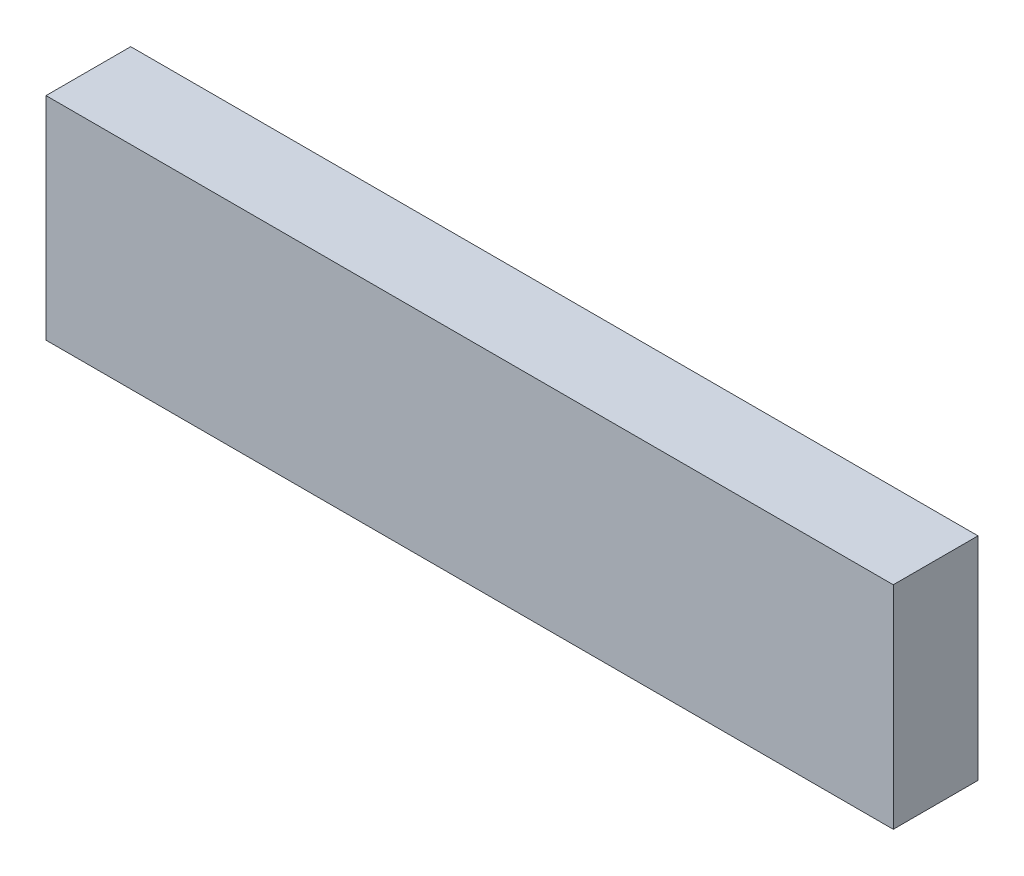
ISO-10303-21;
HEADER;
FILE_DESCRIPTION(('STEP AP214'),'2;1');
FILE_NAME('part.step','',(''),(''),'','','');
FILE_SCHEMA(('AUTOMOTIVE_DESIGN { 1 0 10303 214 1 1 1 1 }'));
ENDSEC;
DATA;
#1=APPLICATION_CONTEXT('core data for automotive mechanical design processes');
#2=APPLICATION_PROTOCOL_DEFINITION('international standard','automotive_design',2000,#1);
#3=PRODUCT_CONTEXT('',#1,'mechanical');
#4=PRODUCT('Part','Part','',(#3));
#5=PRODUCT_RELATED_PRODUCT_CATEGORY('part','',(#4));
#6=PRODUCT_DEFINITION_FORMATION('','',#4);
#7=PRODUCT_DEFINITION_CONTEXT('part definition',#1,'design');
#8=PRODUCT_DEFINITION('design','',#6,#7);
#9=PRODUCT_DEFINITION_SHAPE('','',#8);
#10=(LENGTH_UNIT() NAMED_UNIT(*) SI_UNIT(.MILLI.,.METRE.));
#11=(NAMED_UNIT(*) PLANE_ANGLE_UNIT() SI_UNIT($,.RADIAN.));
#12=(NAMED_UNIT(*) SI_UNIT($,.STERADIAN.) SOLID_ANGLE_UNIT());
#13=UNCERTAINTY_MEASURE_WITH_UNIT(LENGTH_MEASURE(1.E-05),#10,'distance_accuracy_value','');
#14=(GEOMETRIC_REPRESENTATION_CONTEXT(3) GLOBAL_UNCERTAINTY_ASSIGNED_CONTEXT((#13)) GLOBAL_UNIT_ASSIGNED_CONTEXT((#10,
#11,#12)) REPRESENTATION_CONTEXT('',''));
#15=CARTESIAN_POINT('',(0.,0.,0.));
#16=DIRECTION('',(0.,0.,1.));
#17=DIRECTION('',(1.,0.,0.));
#18=AXIS2_PLACEMENT_3D('',#15,#16,#17);
#19=CARTESIAN_POINT('',(96.,46.99,55.8));
#20=DIRECTION('',(0.,0.,-1.));
#21=DIRECTION('',(-1.,0.,0.));
#22=AXIS2_PLACEMENT_3D('',#19,#20,#21);
#23=PLANE('',#22);
#24=DIRECTION('',(0.,1.,0.));
#25=VECTOR('',#24,1.);
#26=CARTESIAN_POINT('',(108.,46.99,55.8));
#27=LINE('',#26,#25);
#28=CARTESIAN_POINT('',(108.,47.,55.8));
#29=VERTEX_POINT('',#28);
#30=CARTESIAN_POINT('',(108.,50.,55.8));
#31=VERTEX_POINT('',#30);
#32=EDGE_CURVE('E11',#29,#31,#27,.T.);
#33=ORIENTED_EDGE('',*,*,#32,.F.);
#34=DIRECTION('',(-1.,0.,0.));
#35=VECTOR('',#34,1.);
#36=CARTESIAN_POINT('',(300.,47.,55.8));
#37=LINE('',#36,#35);
#38=CARTESIAN_POINT('',(96.,47.,55.8));
#39=VERTEX_POINT('',#38);
#40=EDGE_CURVE('E39',#29,#39,#37,.T.);
#41=ORIENTED_EDGE('',*,*,#40,.T.);
#42=DIRECTION('',(0.,1.,0.));
#43=VECTOR('',#42,1.);
#44=CARTESIAN_POINT('',(96.,46.99,55.8));
#45=LINE('',#44,#43);
#46=CARTESIAN_POINT('',(96.,50.,55.8));
#47=VERTEX_POINT('',#46);
#48=EDGE_CURVE('E44',#39,#47,#45,.T.);
#49=ORIENTED_EDGE('',*,*,#48,.T.);
#50=DIRECTION('',(1.,0.,0.));
#51=VECTOR('',#50,1.);
#52=CARTESIAN_POINT('',(-300.,50.,55.8));
#53=LINE('',#52,#51);
#54=EDGE_CURVE('E94',#47,#31,#53,.T.);
#55=ORIENTED_EDGE('',*,*,#54,.T.);
#56=EDGE_LOOP('',(#33,#41,#49,#55));
#57=FACE_BOUND('',#56,.T.);
#58=ADVANCED_FACE('F35',(#57),#23,.T.);
#59=CARTESIAN_POINT('',(108.,46.99,55.8));
#60=DIRECTION('',(1.,0.,0.));
#61=DIRECTION('',(0.,0.,-1.));
#62=AXIS2_PLACEMENT_3D('',#59,#60,#61);
#63=PLANE('',#62);
#64=DIRECTION('',(0.,1.,0.));
#65=VECTOR('',#64,1.);
#66=CARTESIAN_POINT('',(108.,46.99,57.));
#67=LINE('',#66,#65);
#68=CARTESIAN_POINT('',(108.,47.,57.));
#69=VERTEX_POINT('',#68);
#70=CARTESIAN_POINT('',(108.,50.,57.));
#71=VERTEX_POINT('',#70);
#72=EDGE_CURVE('E83',#69,#71,#67,.T.);
#73=ORIENTED_EDGE('',*,*,#72,.F.);
#74=DIRECTION('',(0.,0.,-1.));
#75=VECTOR('',#74,1.);
#76=CARTESIAN_POINT('',(108.,47.,3.));
#77=LINE('',#76,#75);
#78=EDGE_CURVE('E102',#69,#29,#77,.T.);
#79=ORIENTED_EDGE('',*,*,#78,.T.);
#80=ORIENTED_EDGE('',*,*,#32,.T.);
#81=DIRECTION('',(0.,0.,1.));
#82=VECTOR('',#81,1.);
#83=CARTESIAN_POINT('',(108.,50.,60.));
#84=LINE('',#83,#82);
#85=EDGE_CURVE('E91',#31,#71,#84,.T.);
#86=ORIENTED_EDGE('',*,*,#85,.T.);
#87=EDGE_LOOP('',(#73,#79,#80,#86));
#88=FACE_BOUND('',#87,.T.);
#89=ADVANCED_FACE('F114',(#88),#63,.T.);
#90=CARTESIAN_POINT('',(96.,46.99,55.8));
#91=DIRECTION('',(-1.,0.,0.));
#92=DIRECTION('',(0.,0.,1.));
#93=AXIS2_PLACEMENT_3D('',#90,#91,#92);
#94=PLANE('',#93);
#95=ORIENTED_EDGE('',*,*,#48,.F.);
#96=DIRECTION('',(0.,0.,1.));
#97=VECTOR('',#96,1.);
#98=CARTESIAN_POINT('',(96.,47.,3.));
#99=LINE('',#98,#97);
#100=CARTESIAN_POINT('',(96.,47.,57.));
#101=VERTEX_POINT('',#100);
#102=EDGE_CURVE('E79',#39,#101,#99,.T.);
#103=ORIENTED_EDGE('',*,*,#102,.T.);
#104=DIRECTION('',(0.,1.,0.));
#105=VECTOR('',#104,1.);
#106=CARTESIAN_POINT('',(96.,46.99,57.));
#107=LINE('',#106,#105);
#108=CARTESIAN_POINT('',(96.,50.,57.));
#109=VERTEX_POINT('',#108);
#110=EDGE_CURVE('E73',#101,#109,#107,.T.);
#111=ORIENTED_EDGE('',*,*,#110,.T.);
#112=DIRECTION('',(0.,0.,-1.));
#113=VECTOR('',#112,1.);
#114=CARTESIAN_POINT('',(96.,50.,60.));
#115=LINE('',#114,#113);
#116=EDGE_CURVE('E77',#109,#47,#115,.T.);
#117=ORIENTED_EDGE('',*,*,#116,.T.);
#118=EDGE_LOOP('',(#95,#103,#111,#117));
#119=FACE_BOUND('',#118,.T.);
#120=ADVANCED_FACE('F75',(#119),#94,.T.);
#121=CARTESIAN_POINT('',(96.,46.99,57.));
#122=DIRECTION('',(0.,0.,1.));
#123=DIRECTION('',(1.,0.,0.));
#124=AXIS2_PLACEMENT_3D('',#121,#122,#123);
#125=PLANE('',#124);
#126=ORIENTED_EDGE('',*,*,#110,.F.);
#127=DIRECTION('',(1.,0.,0.));
#128=VECTOR('',#127,1.);
#129=CARTESIAN_POINT('',(300.,47.,57.));
#130=LINE('',#129,#128);
#131=EDGE_CURVE('E101',#101,#69,#130,.T.);
#132=ORIENTED_EDGE('',*,*,#131,.T.);
#133=ORIENTED_EDGE('',*,*,#72,.T.);
#134=DIRECTION('',(-1.,0.,0.));
#135=VECTOR('',#134,1.);
#136=CARTESIAN_POINT('',(-300.,50.,57.));
#137=LINE('',#136,#135);
#138=EDGE_CURVE('E86',#71,#109,#137,.T.);
#139=ORIENTED_EDGE('',*,*,#138,.T.);
#140=EDGE_LOOP('',(#126,#132,#133,#139));
#141=FACE_BOUND('',#140,.T.);
#142=ADVANCED_FACE('F87',(#141),#125,.T.);
#143=CARTESIAN_POINT('',(300.,47.,3.));
#144=DIRECTION('',(0.,1.,0.));
#145=DIRECTION('',(0.,0.,1.));
#146=AXIS2_PLACEMENT_3D('',#143,#144,#145);
#147=PLANE('',#146);
#148=ORIENTED_EDGE('',*,*,#102,.F.);
#149=ORIENTED_EDGE('',*,*,#40,.F.);
#150=ORIENTED_EDGE('',*,*,#78,.F.);
#151=ORIENTED_EDGE('',*,*,#131,.F.);
#152=EDGE_LOOP('',(#148,#149,#150,#151));
#153=FACE_BOUND('',#152,.T.);
#154=ADVANCED_FACE('F107',(#153),#147,.F.);
#155=CARTESIAN_POINT('',(-300.,50.,60.));
#156=DIRECTION('',(0.,-1.,0.));
#157=DIRECTION('',(0.,0.,-1.));
#158=AXIS2_PLACEMENT_3D('',#155,#156,#157);
#159=PLANE('',#158);
#160=ORIENTED_EDGE('',*,*,#116,.F.);
#161=ORIENTED_EDGE('',*,*,#138,.F.);
#162=ORIENTED_EDGE('',*,*,#85,.F.);
#163=ORIENTED_EDGE('',*,*,#54,.F.);
#164=EDGE_LOOP('',(#160,#161,#162,#163));
#165=FACE_BOUND('',#164,.T.);
#166=ADVANCED_FACE('F37',(#165),#159,.F.);
#167=CLOSED_SHELL('',(#58,#89,#120,#142,#154,#166));
#168=MANIFOLD_SOLID_BREP('B2',#167);
#169=ADVANCED_BREP_SHAPE_REPRESENTATION('',(#18,#168),#14);
#170=SHAPE_DEFINITION_REPRESENTATION(#9,#169);
ENDSEC;
END-ISO-10303-21;
